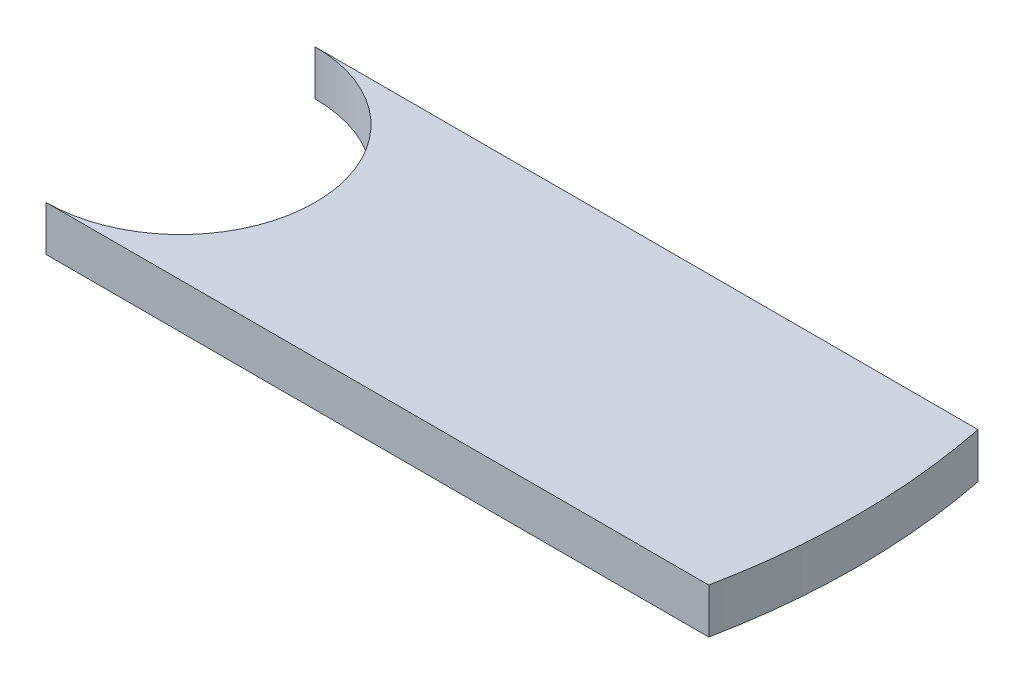
ISO-10303-21;
HEADER;
FILE_DESCRIPTION(('STEP AP214'),'2;1');
FILE_NAME('part.step','',(''),(''),'','','');
FILE_SCHEMA(('AUTOMOTIVE_DESIGN { 1 0 10303 214 1 1 1 1 }'));
ENDSEC;
DATA;
#1=APPLICATION_CONTEXT('core data for automotive mechanical design processes');
#2=APPLICATION_PROTOCOL_DEFINITION('international standard','automotive_design',2000,#1);
#3=PRODUCT_CONTEXT('',#1,'mechanical');
#4=PRODUCT('Part','Part','',(#3));
#5=PRODUCT_RELATED_PRODUCT_CATEGORY('part','',(#4));
#6=PRODUCT_DEFINITION_FORMATION('','',#4);
#7=PRODUCT_DEFINITION_CONTEXT('part definition',#1,'design');
#8=PRODUCT_DEFINITION('design','',#6,#7);
#9=PRODUCT_DEFINITION_SHAPE('','',#8);
#10=(LENGTH_UNIT() NAMED_UNIT(*) SI_UNIT(.MILLI.,.METRE.));
#11=(NAMED_UNIT(*) PLANE_ANGLE_UNIT() SI_UNIT($,.RADIAN.));
#12=(NAMED_UNIT(*) SI_UNIT($,.STERADIAN.) SOLID_ANGLE_UNIT());
#13=UNCERTAINTY_MEASURE_WITH_UNIT(LENGTH_MEASURE(1.E-05),#10,'distance_accuracy_value','');
#14=(GEOMETRIC_REPRESENTATION_CONTEXT(3) GLOBAL_UNCERTAINTY_ASSIGNED_CONTEXT((#13)) GLOBAL_UNIT_ASSIGNED_CONTEXT((#10,
#11,#12)) REPRESENTATION_CONTEXT('',''));
#15=CARTESIAN_POINT('',(0.,0.,0.));
#16=DIRECTION('',(0.,0.,1.));
#17=DIRECTION('',(1.,0.,0.));
#18=AXIS2_PLACEMENT_3D('',#15,#16,#17);
#19=CARTESIAN_POINT('',(0.,8.9,0.));
#20=DIRECTION('',(0.,-1.,0.));
#21=DIRECTION('',(0.,0.,-1.));
#22=AXIS2_PLACEMENT_3D('',#19,#20,#21);
#23=CYLINDRICAL_SURFACE('',#22,26.575);
#24=CARTESIAN_POINT('',(0.,0.,0.));
#25=DIRECTION('',(0.,1.,0.));
#26=DIRECTION('',(0.,0.,1.));
#27=AXIS2_PLACEMENT_3D('',#24,#25,#26);
#28=CIRCLE('',#27,26.575);
#29=CARTESIAN_POINT('',(0.,0.,26.575));
#30=VERTEX_POINT('',#29);
#31=CARTESIAN_POINT('',(0.,0.,-26.575));
#32=VERTEX_POINT('',#31);
#33=EDGE_CURVE('E97',#30,#32,#28,.T.);
#34=ORIENTED_EDGE('',*,*,#33,.F.);
#35=DIRECTION('',(0.,-1.,0.));
#36=VECTOR('',#35,1.);
#37=CARTESIAN_POINT('',(0.,8.9,26.575));
#38=LINE('',#37,#36);
#39=CARTESIAN_POINT('',(0.,8.9,26.575));
#40=VERTEX_POINT('',#39);
#41=EDGE_CURVE('E11',#40,#30,#38,.T.);
#42=ORIENTED_EDGE('',*,*,#41,.F.);
#43=CARTESIAN_POINT('',(0.,8.9,0.));
#44=DIRECTION('',(0.,1.,0.));
#45=DIRECTION('',(0.,0.,1.));
#46=AXIS2_PLACEMENT_3D('',#43,#44,#45);
#47=CIRCLE('',#46,26.575);
#48=CARTESIAN_POINT('',(0.,8.9,-26.575));
#49=VERTEX_POINT('',#48);
#50=EDGE_CURVE('E91',#40,#49,#47,.T.);
#51=ORIENTED_EDGE('',*,*,#50,.T.);
#52=DIRECTION('',(0.,-1.,0.));
#53=VECTOR('',#52,1.);
#54=CARTESIAN_POINT('',(0.,8.9,-26.575));
#55=LINE('',#54,#53);
#56=EDGE_CURVE('E35',#49,#32,#55,.T.);
#57=ORIENTED_EDGE('',*,*,#56,.T.);
#58=EDGE_LOOP('',(#34,#42,#51,#57));
#59=FACE_BOUND('',#58,.T.);
#60=ADVANCED_FACE('F32',(#59),#23,.F.);
#61=CARTESIAN_POINT('',(0.,8.9,26.575));
#62=DIRECTION('',(0.,0.,-1.));
#63=DIRECTION('',(-1.,0.,0.));
#64=AXIS2_PLACEMENT_3D('',#61,#62,#63);
#65=PLANE('',#64);
#66=DIRECTION('',(1.,0.,0.));
#67=VECTOR('',#66,1.);
#68=CARTESIAN_POINT('',(0.,0.,26.575));
#69=LINE('',#68,#67);
#70=CARTESIAN_POINT('',(130.828205578919,0.,26.575));
#71=VERTEX_POINT('',#70);
#72=EDGE_CURVE('E93',#30,#71,#69,.T.);
#73=ORIENTED_EDGE('',*,*,#72,.T.);
#74=DIRECTION('',(0.,-1.,0.));
#75=VECTOR('',#74,1.);
#76=CARTESIAN_POINT('',(130.828205578919,8.9,26.575));
#77=LINE('',#76,#75);
#78=CARTESIAN_POINT('',(130.828205578919,8.9,26.575));
#79=VERTEX_POINT('',#78);
#80=EDGE_CURVE('E41',#79,#71,#77,.T.);
#81=ORIENTED_EDGE('',*,*,#80,.F.);
#82=DIRECTION('',(1.,0.,0.));
#83=VECTOR('',#82,1.);
#84=CARTESIAN_POINT('',(0.,8.9,26.575));
#85=LINE('',#84,#83);
#86=EDGE_CURVE('E82',#40,#79,#85,.T.);
#87=ORIENTED_EDGE('',*,*,#86,.F.);
#88=ORIENTED_EDGE('',*,*,#41,.T.);
#89=EDGE_LOOP('',(#73,#81,#87,#88));
#90=FACE_BOUND('',#89,.T.);
#91=ADVANCED_FACE('F104',(#90),#65,.F.);
#92=CARTESIAN_POINT('',(0.,8.9,0.));
#93=DIRECTION('',(0.,-1.,0.));
#94=DIRECTION('',(0.,0.,-1.));
#95=AXIS2_PLACEMENT_3D('',#92,#93,#94);
#96=CYLINDRICAL_SURFACE('',#95,133.5);
#97=CARTESIAN_POINT('',(0.,0.,0.));
#98=DIRECTION('',(0.,-1.,0.));
#99=DIRECTION('',(0.,0.,-1.));
#100=AXIS2_PLACEMENT_3D('',#97,#98,#99);
#101=CIRCLE('',#100,133.5);
#102=CARTESIAN_POINT('',(130.828205578919,0.,-26.575));
#103=VERTEX_POINT('',#102);
#104=EDGE_CURVE('E88',#103,#71,#101,.T.);
#105=ORIENTED_EDGE('',*,*,#104,.F.);
#106=DIRECTION('',(0.,-1.,0.));
#107=VECTOR('',#106,1.);
#108=CARTESIAN_POINT('',(130.828205578919,8.9,-26.575));
#109=LINE('',#108,#107);
#110=CARTESIAN_POINT('',(130.828205578919,8.9,-26.575));
#111=VERTEX_POINT('',#110);
#112=EDGE_CURVE('E85',#111,#103,#109,.T.);
#113=ORIENTED_EDGE('',*,*,#112,.F.);
#114=CARTESIAN_POINT('',(0.,8.9,0.));
#115=DIRECTION('',(0.,1.,0.));
#116=DIRECTION('',(0.,0.,1.));
#117=AXIS2_PLACEMENT_3D('',#114,#115,#116);
#118=CIRCLE('',#117,133.5);
#119=EDGE_CURVE('E77',#79,#111,#118,.T.);
#120=ORIENTED_EDGE('',*,*,#119,.F.);
#121=ORIENTED_EDGE('',*,*,#80,.T.);
#122=EDGE_LOOP('',(#105,#113,#120,#121));
#123=FACE_BOUND('',#122,.T.);
#124=ADVANCED_FACE('F86',(#123),#96,.T.);
#125=CARTESIAN_POINT('',(0.,8.9,-26.575));
#126=DIRECTION('',(0.,0.,-1.));
#127=DIRECTION('',(-1.,0.,0.));
#128=AXIS2_PLACEMENT_3D('',#125,#126,#127);
#129=PLANE('',#128);
#130=DIRECTION('',(1.,0.,0.));
#131=VECTOR('',#130,1.);
#132=CARTESIAN_POINT('',(0.,0.,-26.575));
#133=LINE('',#132,#131);
#134=EDGE_CURVE('E100',#32,#103,#133,.T.);
#135=ORIENTED_EDGE('',*,*,#134,.F.);
#136=ORIENTED_EDGE('',*,*,#56,.F.);
#137=DIRECTION('',(1.,0.,0.));
#138=VECTOR('',#137,1.);
#139=CARTESIAN_POINT('',(0.,8.9,-26.575));
#140=LINE('',#139,#138);
#141=EDGE_CURVE('E81',#49,#111,#140,.T.);
#142=ORIENTED_EDGE('',*,*,#141,.T.);
#143=ORIENTED_EDGE('',*,*,#112,.T.);
#144=EDGE_LOOP('',(#135,#136,#142,#143));
#145=FACE_BOUND('',#144,.T.);
#146=ADVANCED_FACE('F90',(#145),#129,.T.);
#147=CARTESIAN_POINT('',(0.,8.9,0.));
#148=DIRECTION('',(0.,1.,0.));
#149=DIRECTION('',(0.,0.,1.));
#150=AXIS2_PLACEMENT_3D('',#147,#148,#149);
#151=PLANE('',#150);
#152=ORIENTED_EDGE('',*,*,#50,.F.);
#153=ORIENTED_EDGE('',*,*,#86,.T.);
#154=ORIENTED_EDGE('',*,*,#119,.T.);
#155=ORIENTED_EDGE('',*,*,#141,.F.);
#156=EDGE_LOOP('',(#152,#153,#154,#155));
#157=FACE_BOUND('',#156,.T.);
#158=ADVANCED_FACE('F80',(#157),#151,.T.);
#159=CARTESIAN_POINT('',(0.,0.,0.));
#160=DIRECTION('',(0.,1.,0.));
#161=DIRECTION('',(0.,0.,1.));
#162=AXIS2_PLACEMENT_3D('',#159,#160,#161);
#163=PLANE('',#162);
#164=ORIENTED_EDGE('',*,*,#33,.T.);
#165=ORIENTED_EDGE('',*,*,#134,.T.);
#166=ORIENTED_EDGE('',*,*,#104,.T.);
#167=ORIENTED_EDGE('',*,*,#72,.F.);
#168=EDGE_LOOP('',(#164,#165,#166,#167));
#169=FACE_BOUND('',#168,.T.);
#170=ADVANCED_FACE('F106',(#169),#163,.F.);
#171=CLOSED_SHELL('',(#60,#91,#124,#146,#158,#170));
#172=MANIFOLD_SOLID_BREP('B2',#171);
#173=ADVANCED_BREP_SHAPE_REPRESENTATION('',(#18,#172),#14);
#174=SHAPE_DEFINITION_REPRESENTATION(#9,#173);
ENDSEC;
END-ISO-10303-21;
